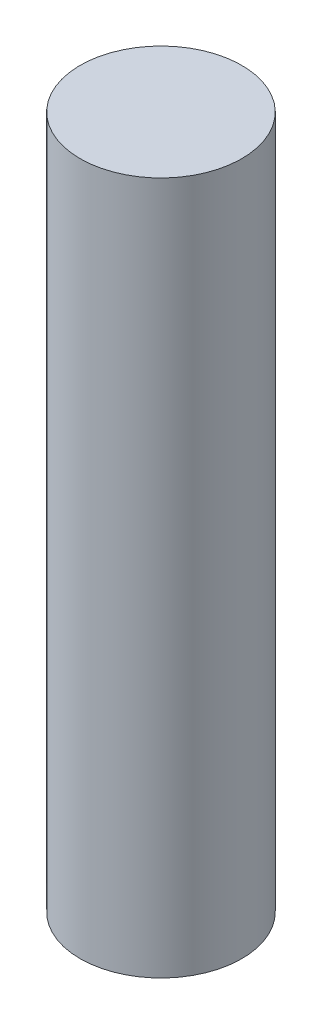
ISO-10303-21;
HEADER;
FILE_DESCRIPTION(('STEP AP214'),'2;1');
FILE_NAME('part.step','',(''),(''),'','','');
FILE_SCHEMA(('AUTOMOTIVE_DESIGN { 1 0 10303 214 1 1 1 1 }'));
ENDSEC;
DATA;
#1=APPLICATION_CONTEXT('core data for automotive mechanical design processes');
#2=APPLICATION_PROTOCOL_DEFINITION('international standard','automotive_design',2000,#1);
#3=PRODUCT_CONTEXT('',#1,'mechanical');
#4=PRODUCT('Part','Part','',(#3));
#5=PRODUCT_RELATED_PRODUCT_CATEGORY('part','',(#4));
#6=PRODUCT_DEFINITION_FORMATION('','',#4);
#7=PRODUCT_DEFINITION_CONTEXT('part definition',#1,'design');
#8=PRODUCT_DEFINITION('design','',#6,#7);
#9=PRODUCT_DEFINITION_SHAPE('','',#8);
#10=(LENGTH_UNIT() NAMED_UNIT(*) SI_UNIT(.MILLI.,.METRE.));
#11=(NAMED_UNIT(*) PLANE_ANGLE_UNIT() SI_UNIT($,.RADIAN.));
#12=(NAMED_UNIT(*) SI_UNIT($,.STERADIAN.) SOLID_ANGLE_UNIT());
#13=UNCERTAINTY_MEASURE_WITH_UNIT(LENGTH_MEASURE(1.E-05),#10,'distance_accuracy_value','');
#14=(GEOMETRIC_REPRESENTATION_CONTEXT(3) GLOBAL_UNCERTAINTY_ASSIGNED_CONTEXT((#13)) GLOBAL_UNIT_ASSIGNED_CONTEXT((#10,
#11,#12)) REPRESENTATION_CONTEXT('',''));
#15=CARTESIAN_POINT('',(0.,0.,0.));
#16=DIRECTION('',(0.,0.,1.));
#17=DIRECTION('',(1.,0.,0.));
#18=AXIS2_PLACEMENT_3D('',#15,#16,#17);
#19=CARTESIAN_POINT('',(0.,29.999999944,0.));
#20=DIRECTION('',(0.,-1.,0.));
#21=DIRECTION('',(0.,0.,-1.));
#22=AXIS2_PLACEMENT_3D('',#19,#20,#21);
#23=CYLINDRICAL_SURFACE('',#22,3.5);
#24=CARTESIAN_POINT('',(0.,29.999999944,0.));
#25=DIRECTION('',(0.,1.,0.));
#26=DIRECTION('',(0.,0.,1.));
#27=AXIS2_PLACEMENT_3D('',#24,#25,#26);
#28=CIRCLE('',#27,3.5);
#29=CARTESIAN_POINT('',(0.,29.999999944,3.5));
#30=VERTEX_POINT('',#29);
#31=EDGE_CURVE('E10',#30,#30,#28,.T.);
#32=ORIENTED_EDGE('',*,*,#31,.F.);
#33=EDGE_LOOP('',(#32));
#34=FACE_BOUND('',#33,.T.);
#35=CARTESIAN_POINT('',(0.,0.,0.));
#36=DIRECTION('',(0.,1.,0.));
#37=DIRECTION('',(0.,0.,1.));
#38=AXIS2_PLACEMENT_3D('',#35,#36,#37);
#39=CIRCLE('',#38,3.5);
#40=CARTESIAN_POINT('',(0.,0.,3.5));
#41=VERTEX_POINT('',#40);
#42=EDGE_CURVE('E39',#41,#41,#39,.T.);
#43=ORIENTED_EDGE('',*,*,#42,.T.);
#44=EDGE_LOOP('',(#43));
#45=FACE_BOUND('',#44,.T.);
#46=ADVANCED_FACE('F36',(#34,#45),#23,.T.);
#47=CARTESIAN_POINT('',(0.,29.999999944,0.));
#48=DIRECTION('',(0.,1.,0.));
#49=DIRECTION('',(0.,0.,1.));
#50=AXIS2_PLACEMENT_3D('',#47,#48,#49);
#51=PLANE('',#50);
#52=ORIENTED_EDGE('',*,*,#31,.T.);
#53=EDGE_LOOP('',(#52));
#54=FACE_BOUND('',#53,.T.);
#55=ADVANCED_FACE('F69',(#54),#51,.T.);
#56=CARTESIAN_POINT('',(0.,0.,0.));
#57=DIRECTION('',(0.,1.,0.));
#58=DIRECTION('',(0.,0.,1.));
#59=AXIS2_PLACEMENT_3D('',#56,#57,#58);
#60=PLANE('',#59);
#61=CARTESIAN_POINT('',(0.,0.,0.));
#62=DIRECTION('',(0.,-1.,0.));
#63=DIRECTION('',(0.,0.,-1.));
#64=AXIS2_PLACEMENT_3D('',#61,#62,#63);
#65=CIRCLE('',#64,2.43);
#66=CARTESIAN_POINT('',(0.,0.,-2.43));
#67=VERTEX_POINT('',#66);
#68=EDGE_CURVE('E50',#67,#67,#65,.T.);
#69=ORIENTED_EDGE('',*,*,#68,.F.);
#70=EDGE_LOOP('',(#69));
#71=FACE_BOUND('',#70,.T.);
#72=ORIENTED_EDGE('',*,*,#42,.F.);
#73=EDGE_LOOP('',(#72));
#74=FACE_BOUND('',#73,.T.);
#75=ADVANCED_FACE('F63',(#71,#74),#60,.F.);
#76=CARTESIAN_POINT('',(0.,3.,0.));
#77=DIRECTION('',(0.,-1.,0.));
#78=DIRECTION('',(0.,0.,-1.));
#79=AXIS2_PLACEMENT_3D('',#76,#77,#78);
#80=CYLINDRICAL_SURFACE('',#79,2.43);
#81=CARTESIAN_POINT('',(0.,3.,0.));
#82=DIRECTION('',(0.,-1.,0.));
#83=DIRECTION('',(0.,0.,-1.));
#84=AXIS2_PLACEMENT_3D('',#81,#82,#83);
#85=CIRCLE('',#84,2.43);
#86=CARTESIAN_POINT('',(0.,3.,-2.43));
#87=VERTEX_POINT('',#86);
#88=EDGE_CURVE('E48',#87,#87,#85,.T.);
#89=ORIENTED_EDGE('',*,*,#88,.F.);
#90=EDGE_LOOP('',(#89));
#91=FACE_BOUND('',#90,.T.);
#92=ORIENTED_EDGE('',*,*,#68,.T.);
#93=EDGE_LOOP('',(#92));
#94=FACE_BOUND('',#93,.T.);
#95=ADVANCED_FACE('F60',(#91,#94),#80,.F.);
#96=CARTESIAN_POINT('',(0.,3.,0.));
#97=DIRECTION('',(0.,-1.,0.));
#98=DIRECTION('',(0.,0.,-1.));
#99=AXIS2_PLACEMENT_3D('',#96,#97,#98);
#100=PLANE('',#99);
#101=ORIENTED_EDGE('',*,*,#88,.T.);
#102=EDGE_LOOP('',(#101));
#103=FACE_BOUND('',#102,.T.);
#104=ADVANCED_FACE('F58',(#103),#100,.T.);
#105=CLOSED_SHELL('',(#46,#55,#75,#95,#104));
#106=MANIFOLD_SOLID_BREP('B2',#105);
#107=ADVANCED_BREP_SHAPE_REPRESENTATION('',(#18,#106),#14);
#108=SHAPE_DEFINITION_REPRESENTATION(#9,#107);
ENDSEC;
END-ISO-10303-21;
